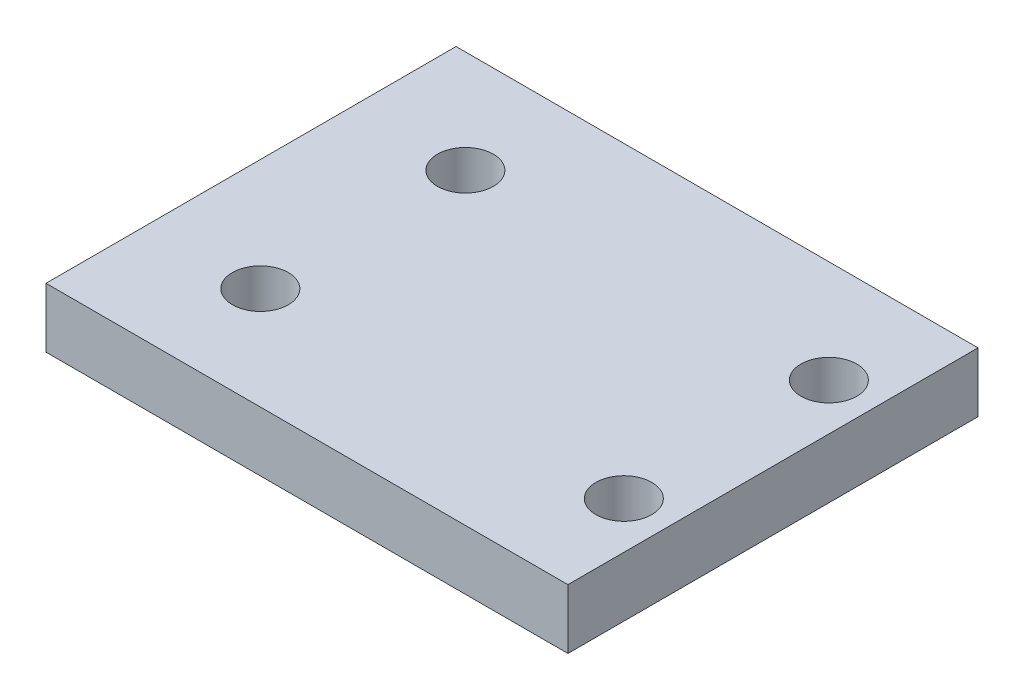
ISO-10303-21;
HEADER;
FILE_DESCRIPTION(('STEP AP214'),'2;1');
FILE_NAME('part.step','',(''),(''),'','','');
FILE_SCHEMA(('AUTOMOTIVE_DESIGN { 1 0 10303 214 1 1 1 1 }'));
ENDSEC;
DATA;
#1=APPLICATION_CONTEXT('core data for automotive mechanical design processes');
#2=APPLICATION_PROTOCOL_DEFINITION('international standard','automotive_design',2000,#1);
#3=PRODUCT_CONTEXT('',#1,'mechanical');
#4=PRODUCT('Part','Part','',(#3));
#5=PRODUCT_RELATED_PRODUCT_CATEGORY('part','',(#4));
#6=PRODUCT_DEFINITION_FORMATION('','',#4);
#7=PRODUCT_DEFINITION_CONTEXT('part definition',#1,'design');
#8=PRODUCT_DEFINITION('design','',#6,#7);
#9=PRODUCT_DEFINITION_SHAPE('','',#8);
#10=(LENGTH_UNIT() NAMED_UNIT(*) SI_UNIT(.MILLI.,.METRE.));
#11=(NAMED_UNIT(*) PLANE_ANGLE_UNIT() SI_UNIT($,.RADIAN.));
#12=(NAMED_UNIT(*) SI_UNIT($,.STERADIAN.) SOLID_ANGLE_UNIT());
#13=UNCERTAINTY_MEASURE_WITH_UNIT(LENGTH_MEASURE(1.E-05),#10,'distance_accuracy_value','');
#14=(GEOMETRIC_REPRESENTATION_CONTEXT(3) GLOBAL_UNCERTAINTY_ASSIGNED_CONTEXT((#13)) GLOBAL_UNIT_ASSIGNED_CONTEXT((#10,
#11,#12)) REPRESENTATION_CONTEXT('',''));
#15=CARTESIAN_POINT('',(0.,0.,0.));
#16=DIRECTION('',(0.,0.,1.));
#17=DIRECTION('',(1.,0.,0.));
#18=AXIS2_PLACEMENT_3D('',#15,#16,#17);
#19=CARTESIAN_POINT('',(0.,6.4,0.));
#20=DIRECTION('',(0.,1.,0.));
#21=DIRECTION('',(0.,0.,1.));
#22=AXIS2_PLACEMENT_3D('',#19,#20,#21);
#23=PLANE('',#22);
#24=CARTESIAN_POINT('',(23.,6.4,-33.));
#25=DIRECTION('',(0.,1.,0.));
#26=DIRECTION('',(0.,0.,1.));
#27=AXIS2_PLACEMENT_3D('',#24,#25,#26);
#28=CIRCLE('',#27,2.99999999999999);
#29=CARTESIAN_POINT('',(23.,6.4,-30.));
#30=VERTEX_POINT('',#29);
#31=EDGE_CURVE('E131',#30,#30,#28,.T.);
#32=ORIENTED_EDGE('',*,*,#31,.F.);
#33=EDGE_LOOP('',(#32));
#34=FACE_BOUND('',#33,.T.);
#35=CARTESIAN_POINT('',(-16.,6.4,-33.));
#36=DIRECTION('',(0.,1.,0.));
#37=DIRECTION('',(0.,0.,1.));
#38=AXIS2_PLACEMENT_3D('',#35,#36,#37);
#39=CIRCLE('',#38,2.99999999999999);
#40=CARTESIAN_POINT('',(-16.,6.4,-30.));
#41=VERTEX_POINT('',#40);
#42=EDGE_CURVE('E110',#41,#41,#39,.T.);
#43=ORIENTED_EDGE('',*,*,#42,.F.);
#44=EDGE_LOOP('',(#43));
#45=FACE_BOUND('',#44,.T.);
#46=DIRECTION('',(-1.,0.,0.));
#47=VECTOR('',#46,1.);
#48=CARTESIAN_POINT('',(28.,6.4,-44.));
#49=LINE('',#48,#47);
#50=CARTESIAN_POINT('',(28.,6.4,-44.));
#51=VERTEX_POINT('',#50);
#52=CARTESIAN_POINT('',(-28.,6.4,-44.));
#53=VERTEX_POINT('',#52);
#54=EDGE_CURVE('E95',#51,#53,#49,.T.);
#55=ORIENTED_EDGE('',*,*,#54,.T.);
#56=DIRECTION('',(0.,0.,1.));
#57=VECTOR('',#56,1.);
#58=CARTESIAN_POINT('',(-28.,6.4,-44.));
#59=LINE('',#58,#57);
#60=CARTESIAN_POINT('',(-28.,6.4,0.));
#61=VERTEX_POINT('',#60);
#62=EDGE_CURVE('E90',#53,#61,#59,.T.);
#63=ORIENTED_EDGE('',*,*,#62,.T.);
#64=DIRECTION('',(1.,0.,0.));
#65=VECTOR('',#64,1.);
#66=CARTESIAN_POINT('',(-28.,6.4,0.));
#67=LINE('',#66,#65);
#68=CARTESIAN_POINT('',(28.,6.4,0.));
#69=VERTEX_POINT('',#68);
#70=EDGE_CURVE('E93',#61,#69,#67,.T.);
#71=ORIENTED_EDGE('',*,*,#70,.T.);
#72=DIRECTION('',(0.,0.,-1.));
#73=VECTOR('',#72,1.);
#74=CARTESIAN_POINT('',(28.,6.4,0.));
#75=LINE('',#74,#73);
#76=EDGE_CURVE('E60',#69,#51,#75,.T.);
#77=ORIENTED_EDGE('',*,*,#76,.T.);
#78=EDGE_LOOP('',(#55,#63,#71,#77));
#79=FACE_BOUND('',#78,.T.);
#80=CARTESIAN_POINT('',(-16.,6.4,-11.));
#81=DIRECTION('',(0.,1.,0.));
#82=DIRECTION('',(0.,0.,1.));
#83=AXIS2_PLACEMENT_3D('',#80,#81,#82);
#84=CIRCLE('',#83,3.00000000000002);
#85=CARTESIAN_POINT('',(-16.,6.4,-7.99999999999996));
#86=VERTEX_POINT('',#85);
#87=EDGE_CURVE('E125',#86,#86,#84,.T.);
#88=ORIENTED_EDGE('',*,*,#87,.F.);
#89=EDGE_LOOP('',(#88));
#90=FACE_BOUND('',#89,.T.);
#91=CARTESIAN_POINT('',(23.,6.4,-11.));
#92=DIRECTION('',(0.,1.,0.));
#93=DIRECTION('',(0.,0.,1.));
#94=AXIS2_PLACEMENT_3D('',#91,#92,#93);
#95=CIRCLE('',#94,2.99999999999999);
#96=CARTESIAN_POINT('',(23.,6.4,-7.99999999999999));
#97=VERTEX_POINT('',#96);
#98=EDGE_CURVE('E137',#97,#97,#95,.T.);
#99=ORIENTED_EDGE('',*,*,#98,.F.);
#100=EDGE_LOOP('',(#99));
#101=FACE_BOUND('',#100,.T.);
#102=ADVANCED_FACE('F43',(#34,#45,#79,#90,#101),#23,.T.);
#103=CARTESIAN_POINT('',(0.,0.,0.));
#104=DIRECTION('',(0.,1.,0.));
#105=DIRECTION('',(0.,0.,1.));
#106=AXIS2_PLACEMENT_3D('',#103,#104,#105);
#107=PLANE('',#106);
#108=DIRECTION('',(-1.,0.,0.));
#109=VECTOR('',#108,1.);
#110=CARTESIAN_POINT('',(28.,0.,-44.));
#111=LINE('',#110,#109);
#112=CARTESIAN_POINT('',(28.,0.,-44.));
#113=VERTEX_POINT('',#112);
#114=CARTESIAN_POINT('',(-28.,0.,-44.));
#115=VERTEX_POINT('',#114);
#116=EDGE_CURVE('E107',#113,#115,#111,.T.);
#117=ORIENTED_EDGE('',*,*,#116,.F.);
#118=DIRECTION('',(0.,0.,-1.));
#119=VECTOR('',#118,1.);
#120=CARTESIAN_POINT('',(28.,0.,0.));
#121=LINE('',#120,#119);
#122=CARTESIAN_POINT('',(28.,0.,0.));
#123=VERTEX_POINT('',#122);
#124=EDGE_CURVE('E83',#123,#113,#121,.T.);
#125=ORIENTED_EDGE('',*,*,#124,.F.);
#126=DIRECTION('',(1.,0.,0.));
#127=VECTOR('',#126,1.);
#128=CARTESIAN_POINT('',(-28.,0.,0.));
#129=LINE('',#128,#127);
#130=CARTESIAN_POINT('',(-28.,0.,0.));
#131=VERTEX_POINT('',#130);
#132=EDGE_CURVE('E77',#131,#123,#129,.T.);
#133=ORIENTED_EDGE('',*,*,#132,.F.);
#134=DIRECTION('',(0.,0.,1.));
#135=VECTOR('',#134,1.);
#136=CARTESIAN_POINT('',(-28.,0.,-44.));
#137=LINE('',#136,#135);
#138=EDGE_CURVE('E99',#115,#131,#137,.T.);
#139=ORIENTED_EDGE('',*,*,#138,.F.);
#140=EDGE_LOOP('',(#117,#125,#133,#139));
#141=FACE_BOUND('',#140,.T.);
#142=CARTESIAN_POINT('',(-16.,0.,-33.));
#143=DIRECTION('',(0.,1.,0.));
#144=DIRECTION('',(0.,0.,1.));
#145=AXIS2_PLACEMENT_3D('',#142,#143,#144);
#146=CIRCLE('',#145,2.99999999999999);
#147=CARTESIAN_POINT('',(-16.,0.,-30.));
#148=VERTEX_POINT('',#147);
#149=EDGE_CURVE('E122',#148,#148,#146,.T.);
#150=ORIENTED_EDGE('',*,*,#149,.T.);
#151=EDGE_LOOP('',(#150));
#152=FACE_BOUND('',#151,.T.);
#153=CARTESIAN_POINT('',(-16.,0.,-11.));
#154=DIRECTION('',(0.,1.,0.));
#155=DIRECTION('',(0.,0.,1.));
#156=AXIS2_PLACEMENT_3D('',#153,#154,#155);
#157=CIRCLE('',#156,3.00000000000002);
#158=CARTESIAN_POINT('',(-16.,0.,-7.99999999999996));
#159=VERTEX_POINT('',#158);
#160=EDGE_CURVE('E128',#159,#159,#157,.T.);
#161=ORIENTED_EDGE('',*,*,#160,.T.);
#162=EDGE_LOOP('',(#161));
#163=FACE_BOUND('',#162,.T.);
#164=CARTESIAN_POINT('',(23.,0.,-33.));
#165=DIRECTION('',(0.,1.,0.));
#166=DIRECTION('',(0.,0.,1.));
#167=AXIS2_PLACEMENT_3D('',#164,#165,#166);
#168=CIRCLE('',#167,2.99999999999999);
#169=CARTESIAN_POINT('',(23.,0.,-30.));
#170=VERTEX_POINT('',#169);
#171=EDGE_CURVE('E134',#170,#170,#168,.T.);
#172=ORIENTED_EDGE('',*,*,#171,.T.);
#173=EDGE_LOOP('',(#172));
#174=FACE_BOUND('',#173,.T.);
#175=CARTESIAN_POINT('',(23.,0.,-11.));
#176=DIRECTION('',(0.,1.,0.));
#177=DIRECTION('',(0.,0.,1.));
#178=AXIS2_PLACEMENT_3D('',#175,#176,#177);
#179=CIRCLE('',#178,2.99999999999999);
#180=CARTESIAN_POINT('',(23.,0.,-7.99999999999999));
#181=VERTEX_POINT('',#180);
#182=EDGE_CURVE('E140',#181,#181,#179,.T.);
#183=ORIENTED_EDGE('',*,*,#182,.T.);
#184=EDGE_LOOP('',(#183));
#185=FACE_BOUND('',#184,.T.);
#186=ADVANCED_FACE('F118',(#141,#152,#163,#174,#185),#107,.F.);
#187=CARTESIAN_POINT('',(28.,6.4,-44.));
#188=DIRECTION('',(0.,0.,1.));
#189=DIRECTION('',(1.,0.,0.));
#190=AXIS2_PLACEMENT_3D('',#187,#188,#189);
#191=PLANE('',#190);
#192=ORIENTED_EDGE('',*,*,#116,.T.);
#193=DIRECTION('',(0.,-1.,0.));
#194=VECTOR('',#193,1.);
#195=CARTESIAN_POINT('',(-28.,6.4,-44.));
#196=LINE('',#195,#194);
#197=EDGE_CURVE('E11',#53,#115,#196,.T.);
#198=ORIENTED_EDGE('',*,*,#197,.F.);
#199=ORIENTED_EDGE('',*,*,#54,.F.);
#200=DIRECTION('',(0.,-1.,0.));
#201=VECTOR('',#200,1.);
#202=CARTESIAN_POINT('',(28.,6.4,-44.));
#203=LINE('',#202,#201);
#204=EDGE_CURVE('E103',#51,#113,#203,.T.);
#205=ORIENTED_EDGE('',*,*,#204,.T.);
#206=EDGE_LOOP('',(#192,#198,#199,#205));
#207=FACE_BOUND('',#206,.T.);
#208=ADVANCED_FACE('F45',(#207),#191,.F.);
#209=CARTESIAN_POINT('',(-28.,6.4,-44.));
#210=DIRECTION('',(1.,0.,0.));
#211=DIRECTION('',(0.,0.,-1.));
#212=AXIS2_PLACEMENT_3D('',#209,#210,#211);
#213=PLANE('',#212);
#214=ORIENTED_EDGE('',*,*,#138,.T.);
#215=DIRECTION('',(0.,-1.,0.));
#216=VECTOR('',#215,1.);
#217=CARTESIAN_POINT('',(-28.,6.4,0.));
#218=LINE('',#217,#216);
#219=EDGE_CURVE('E52',#61,#131,#218,.T.);
#220=ORIENTED_EDGE('',*,*,#219,.F.);
#221=ORIENTED_EDGE('',*,*,#62,.F.);
#222=ORIENTED_EDGE('',*,*,#197,.T.);
#223=EDGE_LOOP('',(#214,#220,#221,#222));
#224=FACE_BOUND('',#223,.T.);
#225=ADVANCED_FACE('F98',(#224),#213,.F.);
#226=CARTESIAN_POINT('',(-28.,6.4,0.));
#227=DIRECTION('',(0.,0.,-1.));
#228=DIRECTION('',(-1.,0.,0.));
#229=AXIS2_PLACEMENT_3D('',#226,#227,#228);
#230=PLANE('',#229);
#231=ORIENTED_EDGE('',*,*,#132,.T.);
#232=DIRECTION('',(0.,-1.,0.));
#233=VECTOR('',#232,1.);
#234=CARTESIAN_POINT('',(28.,6.4,0.));
#235=LINE('',#234,#233);
#236=EDGE_CURVE('E100',#69,#123,#235,.T.);
#237=ORIENTED_EDGE('',*,*,#236,.F.);
#238=ORIENTED_EDGE('',*,*,#70,.F.);
#239=ORIENTED_EDGE('',*,*,#219,.T.);
#240=EDGE_LOOP('',(#231,#237,#238,#239));
#241=FACE_BOUND('',#240,.T.);
#242=ADVANCED_FACE('F101',(#241),#230,.F.);
#243=CARTESIAN_POINT('',(28.,6.4,0.));
#244=DIRECTION('',(-1.,0.,0.));
#245=DIRECTION('',(0.,0.,1.));
#246=AXIS2_PLACEMENT_3D('',#243,#244,#245);
#247=PLANE('',#246);
#248=ORIENTED_EDGE('',*,*,#124,.T.);
#249=ORIENTED_EDGE('',*,*,#204,.F.);
#250=ORIENTED_EDGE('',*,*,#76,.F.);
#251=ORIENTED_EDGE('',*,*,#236,.T.);
#252=EDGE_LOOP('',(#248,#249,#250,#251));
#253=FACE_BOUND('',#252,.T.);
#254=ADVANCED_FACE('F115',(#253),#247,.F.);
#255=CARTESIAN_POINT('',(-16.,6.4,-33.));
#256=DIRECTION('',(0.,-1.,0.));
#257=DIRECTION('',(0.,0.,-1.));
#258=AXIS2_PLACEMENT_3D('',#255,#256,#257);
#259=CYLINDRICAL_SURFACE('',#258,2.99999999999999);
#260=ORIENTED_EDGE('',*,*,#42,.T.);
#261=EDGE_LOOP('',(#260));
#262=FACE_BOUND('',#261,.T.);
#263=ORIENTED_EDGE('',*,*,#149,.F.);
#264=EDGE_LOOP('',(#263));
#265=FACE_BOUND('',#264,.T.);
#266=ADVANCED_FACE('F159',(#262,#265),#259,.F.);
#267=CARTESIAN_POINT('',(-16.,6.4,-11.));
#268=DIRECTION('',(0.,-1.,0.));
#269=DIRECTION('',(0.,0.,-1.));
#270=AXIS2_PLACEMENT_3D('',#267,#268,#269);
#271=CYLINDRICAL_SURFACE('',#270,3.00000000000002);
#272=ORIENTED_EDGE('',*,*,#87,.T.);
#273=EDGE_LOOP('',(#272));
#274=FACE_BOUND('',#273,.T.);
#275=ORIENTED_EDGE('',*,*,#160,.F.);
#276=EDGE_LOOP('',(#275));
#277=FACE_BOUND('',#276,.T.);
#278=ADVANCED_FACE('F204',(#274,#277),#271,.F.);
#279=CARTESIAN_POINT('',(23.,6.4,-33.));
#280=DIRECTION('',(0.,-1.,0.));
#281=DIRECTION('',(0.,0.,-1.));
#282=AXIS2_PLACEMENT_3D('',#279,#280,#281);
#283=CYLINDRICAL_SURFACE('',#282,2.99999999999999);
#284=ORIENTED_EDGE('',*,*,#31,.T.);
#285=EDGE_LOOP('',(#284));
#286=FACE_BOUND('',#285,.T.);
#287=ORIENTED_EDGE('',*,*,#171,.F.);
#288=EDGE_LOOP('',(#287));
#289=FACE_BOUND('',#288,.T.);
#290=ADVANCED_FACE('F212',(#286,#289),#283,.F.);
#291=CARTESIAN_POINT('',(23.,6.4,-11.));
#292=DIRECTION('',(0.,-1.,0.));
#293=DIRECTION('',(0.,0.,-1.));
#294=AXIS2_PLACEMENT_3D('',#291,#292,#293);
#295=CYLINDRICAL_SURFACE('',#294,2.99999999999999);
#296=ORIENTED_EDGE('',*,*,#98,.T.);
#297=EDGE_LOOP('',(#296));
#298=FACE_BOUND('',#297,.T.);
#299=ORIENTED_EDGE('',*,*,#182,.F.);
#300=EDGE_LOOP('',(#299));
#301=FACE_BOUND('',#300,.T.);
#302=ADVANCED_FACE('F146',(#298,#301),#295,.F.);
#303=CLOSED_SHELL('',(#102,#186,#208,#225,#242,#254,#266,#278,#290,#302));
#304=MANIFOLD_SOLID_BREP('B2',#303);
#305=ADVANCED_BREP_SHAPE_REPRESENTATION('',(#18,#304),#14);
#306=SHAPE_DEFINITION_REPRESENTATION(#9,#305);
ENDSEC;
END-ISO-10303-21;
